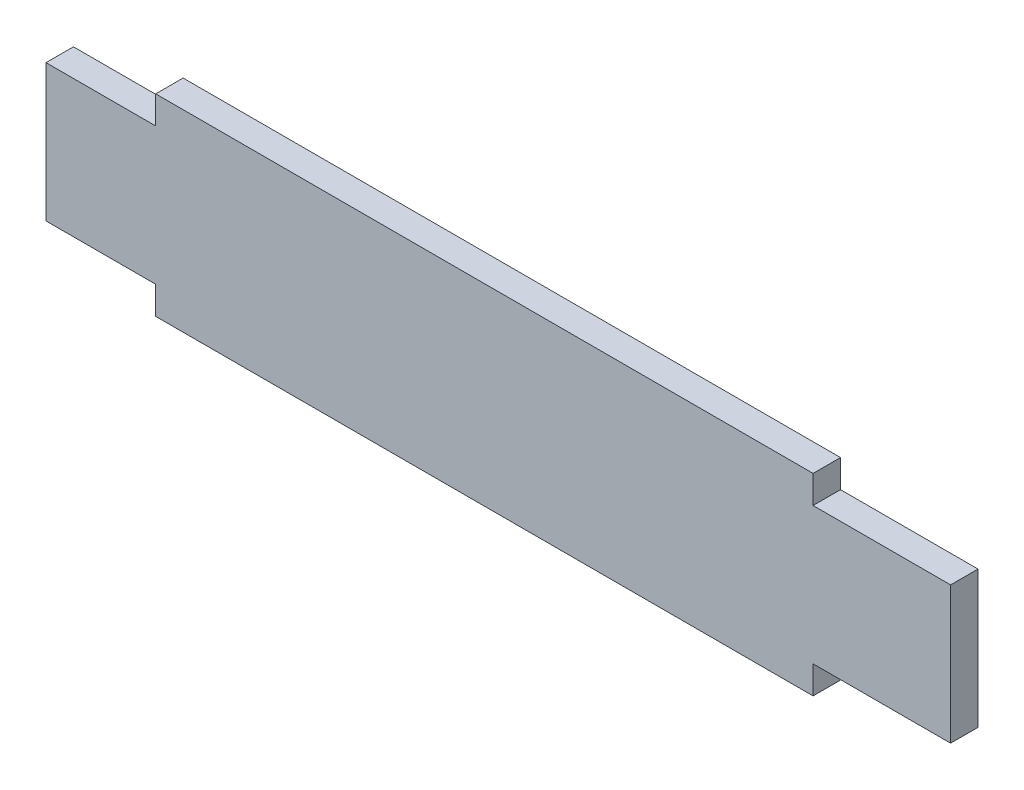
ISO-10303-21;
HEADER;
FILE_DESCRIPTION(('STEP AP214'),'2;1');
FILE_NAME('part.step','',(''),(''),'','','');
FILE_SCHEMA(('AUTOMOTIVE_DESIGN { 1 0 10303 214 1 1 1 1 }'));
ENDSEC;
DATA;
#1=APPLICATION_CONTEXT('core data for automotive mechanical design processes');
#2=APPLICATION_PROTOCOL_DEFINITION('international standard','automotive_design',2000,#1);
#3=PRODUCT_CONTEXT('',#1,'mechanical');
#4=PRODUCT('Part','Part','',(#3));
#5=PRODUCT_RELATED_PRODUCT_CATEGORY('part','',(#4));
#6=PRODUCT_DEFINITION_FORMATION('','',#4);
#7=PRODUCT_DEFINITION_CONTEXT('part definition',#1,'design');
#8=PRODUCT_DEFINITION('design','',#6,#7);
#9=PRODUCT_DEFINITION_SHAPE('','',#8);
#10=(LENGTH_UNIT() NAMED_UNIT(*) SI_UNIT(.MILLI.,.METRE.));
#11=(NAMED_UNIT(*) PLANE_ANGLE_UNIT() SI_UNIT($,.RADIAN.));
#12=(NAMED_UNIT(*) SI_UNIT($,.STERADIAN.) SOLID_ANGLE_UNIT());
#13=UNCERTAINTY_MEASURE_WITH_UNIT(LENGTH_MEASURE(1.E-05),#10,'distance_accuracy_value','');
#14=(GEOMETRIC_REPRESENTATION_CONTEXT(3) GLOBAL_UNCERTAINTY_ASSIGNED_CONTEXT((#13)) GLOBAL_UNIT_ASSIGNED_CONTEXT((#10,
#11,#12)) REPRESENTATION_CONTEXT('',''));
#15=CARTESIAN_POINT('',(0.,0.,0.));
#16=DIRECTION('',(0.,0.,1.));
#17=DIRECTION('',(1.,0.,0.));
#18=AXIS2_PLACEMENT_3D('',#15,#16,#17);
#19=CARTESIAN_POINT('',(0.,0.,5.));
#20=DIRECTION('',(0.,1.,0.));
#21=DIRECTION('',(0.,0.,1.));
#22=AXIS2_PLACEMENT_3D('',#19,#20,#21);
#23=PLANE('',#22);
#24=DIRECTION('',(1.,0.,0.));
#25=VECTOR('',#24,1.);
#26=CARTESIAN_POINT('',(0.,0.,0.));
#27=LINE('',#26,#25);
#28=CARTESIAN_POINT('',(0.,0.,0.));
#29=VERTEX_POINT('',#28);
#30=CARTESIAN_POINT('',(20.,0.,0.));
#31=VERTEX_POINT('',#30);
#32=EDGE_CURVE('E212',#29,#31,#27,.T.);
#33=ORIENTED_EDGE('',*,*,#32,.T.);
#34=DIRECTION('',(0.,0.,-1.));
#35=VECTOR('',#34,1.);
#36=CARTESIAN_POINT('',(20.,0.,5.));
#37=LINE('',#36,#35);
#38=CARTESIAN_POINT('',(20.,0.,5.));
#39=VERTEX_POINT('',#38);
#40=EDGE_CURVE('E11',#39,#31,#37,.T.);
#41=ORIENTED_EDGE('',*,*,#40,.F.);
#42=DIRECTION('',(1.,0.,0.));
#43=VECTOR('',#42,1.);
#44=CARTESIAN_POINT('',(0.,0.,5.));
#45=LINE('',#44,#43);
#46=CARTESIAN_POINT('',(0.,0.,5.));
#47=VERTEX_POINT('',#46);
#48=EDGE_CURVE('E169',#47,#39,#45,.T.);
#49=ORIENTED_EDGE('',*,*,#48,.F.);
#50=DIRECTION('',(0.,0.,-1.));
#51=VECTOR('',#50,1.);
#52=CARTESIAN_POINT('',(0.,0.,5.));
#53=LINE('',#52,#51);
#54=EDGE_CURVE('E54',#47,#29,#53,.T.);
#55=ORIENTED_EDGE('',*,*,#54,.T.);
#56=EDGE_LOOP('',(#33,#41,#49,#55));
#57=FACE_BOUND('',#56,.T.);
#58=ADVANCED_FACE('F37',(#57),#23,.F.);
#59=CARTESIAN_POINT('',(20.,0.,5.));
#60=DIRECTION('',(1.,0.,0.));
#61=DIRECTION('',(0.,0.,-1.));
#62=AXIS2_PLACEMENT_3D('',#59,#60,#61);
#63=PLANE('',#62);
#64=DIRECTION('',(0.,-1.,0.));
#65=VECTOR('',#64,1.);
#66=CARTESIAN_POINT('',(20.,0.,0.));
#67=LINE('',#66,#65);
#68=CARTESIAN_POINT('',(20.,-5.06999999999997,0.));
#69=VERTEX_POINT('',#68);
#70=EDGE_CURVE('E211',#31,#69,#67,.T.);
#71=ORIENTED_EDGE('',*,*,#70,.T.);
#72=DIRECTION('',(0.,0.,-1.));
#73=VECTOR('',#72,1.);
#74=CARTESIAN_POINT('',(20.,-5.06999999999997,5.));
#75=LINE('',#74,#73);
#76=CARTESIAN_POINT('',(20.,-5.06999999999997,5.));
#77=VERTEX_POINT('',#76);
#78=EDGE_CURVE('E46',#77,#69,#75,.T.);
#79=ORIENTED_EDGE('',*,*,#78,.F.);
#80=DIRECTION('',(0.,-1.,0.));
#81=VECTOR('',#80,1.);
#82=CARTESIAN_POINT('',(20.,0.,5.));
#83=LINE('',#82,#81);
#84=EDGE_CURVE('E104',#39,#77,#83,.T.);
#85=ORIENTED_EDGE('',*,*,#84,.F.);
#86=ORIENTED_EDGE('',*,*,#40,.T.);
#87=EDGE_LOOP('',(#71,#79,#85,#86));
#88=FACE_BOUND('',#87,.T.);
#89=ADVANCED_FACE('F39',(#88),#63,.F.);
#90=CARTESIAN_POINT('',(0.,-5.06999999999997,5.));
#91=DIRECTION('',(0.,-1.,0.));
#92=DIRECTION('',(1.,0.,0.));
#93=AXIS2_PLACEMENT_3D('',#90,#91,#92);
#94=PLANE('',#93);
#95=DIRECTION('',(-1.,0.,0.));
#96=VECTOR('',#95,1.);
#97=CARTESIAN_POINT('',(0.,-5.06999999999997,0.));
#98=LINE('',#97,#96);
#99=CARTESIAN_POINT('',(139.86,-5.07,0.));
#100=VERTEX_POINT('',#99);
#101=EDGE_CURVE('E208',#100,#69,#98,.T.);
#102=ORIENTED_EDGE('',*,*,#101,.F.);
#103=DIRECTION('',(0.,0.,-1.));
#104=VECTOR('',#103,1.);
#105=CARTESIAN_POINT('',(139.86,-5.07,5.));
#106=LINE('',#105,#104);
#107=CARTESIAN_POINT('',(139.86,-5.07,5.));
#108=VERTEX_POINT('',#107);
#109=EDGE_CURVE('E202',#108,#100,#106,.T.);
#110=ORIENTED_EDGE('',*,*,#109,.F.);
#111=DIRECTION('',(-1.,0.,0.));
#112=VECTOR('',#111,1.);
#113=CARTESIAN_POINT('',(0.,-5.06999999999997,5.));
#114=LINE('',#113,#112);
#115=EDGE_CURVE('E173',#108,#77,#114,.T.);
#116=ORIENTED_EDGE('',*,*,#115,.T.);
#117=ORIENTED_EDGE('',*,*,#78,.T.);
#118=EDGE_LOOP('',(#102,#110,#116,#117));
#119=FACE_BOUND('',#118,.T.);
#120=ADVANCED_FACE('F206',(#119),#94,.T.);
#121=CARTESIAN_POINT('',(139.86,0.,5.));
#122=DIRECTION('',(1.,0.,0.));
#123=DIRECTION('',(0.,0.,-1.));
#124=AXIS2_PLACEMENT_3D('',#121,#122,#123);
#125=PLANE('',#124);
#126=DIRECTION('',(0.,-1.,0.));
#127=VECTOR('',#126,1.);
#128=CARTESIAN_POINT('',(139.86,0.,0.));
#129=LINE('',#128,#127);
#130=CARTESIAN_POINT('',(139.86,0.,0.));
#131=VERTEX_POINT('',#130);
#132=EDGE_CURVE('E217',#131,#100,#129,.T.);
#133=ORIENTED_EDGE('',*,*,#132,.F.);
#134=DIRECTION('',(0.,0.,-1.));
#135=VECTOR('',#134,1.);
#136=CARTESIAN_POINT('',(139.86,0.,5.));
#137=LINE('',#136,#135);
#138=CARTESIAN_POINT('',(139.86,0.,5.));
#139=VERTEX_POINT('',#138);
#140=EDGE_CURVE('E200',#139,#131,#137,.T.);
#141=ORIENTED_EDGE('',*,*,#140,.F.);
#142=DIRECTION('',(0.,-1.,0.));
#143=VECTOR('',#142,1.);
#144=CARTESIAN_POINT('',(139.86,0.,5.));
#145=LINE('',#144,#143);
#146=EDGE_CURVE('E167',#139,#108,#145,.T.);
#147=ORIENTED_EDGE('',*,*,#146,.T.);
#148=ORIENTED_EDGE('',*,*,#109,.T.);
#149=EDGE_LOOP('',(#133,#141,#147,#148));
#150=FACE_BOUND('',#149,.T.);
#151=ADVANCED_FACE('F244',(#150),#125,.T.);
#152=CARTESIAN_POINT('',(164.93,0.,0.));
#153=VERTEX_POINT('',#152);
#154=EDGE_CURVE('E219',#131,#153,#27,.T.);
#155=ORIENTED_EDGE('',*,*,#154,.T.);
#156=DIRECTION('',(0.,0.,-1.));
#157=VECTOR('',#156,1.);
#158=CARTESIAN_POINT('',(164.93,0.,5.));
#159=LINE('',#158,#157);
#160=CARTESIAN_POINT('',(164.93,0.,5.));
#161=VERTEX_POINT('',#160);
#162=EDGE_CURVE('E197',#161,#153,#159,.T.);
#163=ORIENTED_EDGE('',*,*,#162,.F.);
#164=EDGE_CURVE('E164',#139,#161,#45,.T.);
#165=ORIENTED_EDGE('',*,*,#164,.F.);
#166=ORIENTED_EDGE('',*,*,#140,.T.);
#167=EDGE_LOOP('',(#155,#163,#165,#166));
#168=FACE_BOUND('',#167,.T.);
#169=ADVANCED_FACE('F247',(#168),#23,.F.);
#170=CARTESIAN_POINT('',(164.93,0.,5.));
#171=DIRECTION('',(-1.,0.,0.));
#172=DIRECTION('',(0.,0.,1.));
#173=AXIS2_PLACEMENT_3D('',#170,#171,#172);
#174=PLANE('',#173);
#175=DIRECTION('',(0.,1.,0.));
#176=VECTOR('',#175,1.);
#177=CARTESIAN_POINT('',(164.93,0.,0.));
#178=LINE('',#177,#176);
#179=CARTESIAN_POINT('',(164.93,25.,0.));
#180=VERTEX_POINT('',#179);
#181=EDGE_CURVE('E223',#153,#180,#178,.T.);
#182=ORIENTED_EDGE('',*,*,#181,.T.);
#183=DIRECTION('',(0.,0.,-1.));
#184=VECTOR('',#183,1.);
#185=CARTESIAN_POINT('',(164.93,25.,5.));
#186=LINE('',#185,#184);
#187=CARTESIAN_POINT('',(164.93,25.,5.));
#188=VERTEX_POINT('',#187);
#189=EDGE_CURVE('E195',#188,#180,#186,.T.);
#190=ORIENTED_EDGE('',*,*,#189,.F.);
#191=DIRECTION('',(0.,1.,0.));
#192=VECTOR('',#191,1.);
#193=CARTESIAN_POINT('',(164.93,0.,5.));
#194=LINE('',#193,#192);
#195=EDGE_CURVE('E161',#161,#188,#194,.T.);
#196=ORIENTED_EDGE('',*,*,#195,.F.);
#197=ORIENTED_EDGE('',*,*,#162,.T.);
#198=EDGE_LOOP('',(#182,#190,#196,#197));
#199=FACE_BOUND('',#198,.T.);
#200=ADVANCED_FACE('F240',(#199),#174,.F.);
#201=CARTESIAN_POINT('',(0.,25.,5.));
#202=DIRECTION('',(0.,1.,0.));
#203=DIRECTION('',(0.,0.,1.));
#204=AXIS2_PLACEMENT_3D('',#201,#202,#203);
#205=PLANE('',#204);
#206=DIRECTION('',(1.,0.,0.));
#207=VECTOR('',#206,1.);
#208=CARTESIAN_POINT('',(0.,25.,0.));
#209=LINE('',#208,#207);
#210=CARTESIAN_POINT('',(139.86,25.,0.));
#211=VERTEX_POINT('',#210);
#212=EDGE_CURVE('E183',#211,#180,#209,.T.);
#213=ORIENTED_EDGE('',*,*,#212,.F.);
#214=DIRECTION('',(0.,0.,-1.));
#215=VECTOR('',#214,1.);
#216=CARTESIAN_POINT('',(139.86,25.,5.));
#217=LINE('',#216,#215);
#218=CARTESIAN_POINT('',(139.86,25.,5.));
#219=VERTEX_POINT('',#218);
#220=EDGE_CURVE('E193',#219,#211,#217,.T.);
#221=ORIENTED_EDGE('',*,*,#220,.F.);
#222=DIRECTION('',(1.,0.,0.));
#223=VECTOR('',#222,1.);
#224=CARTESIAN_POINT('',(0.,25.,5.));
#225=LINE('',#224,#223);
#226=EDGE_CURVE('E155',#219,#188,#225,.T.);
#227=ORIENTED_EDGE('',*,*,#226,.T.);
#228=ORIENTED_EDGE('',*,*,#189,.T.);
#229=EDGE_LOOP('',(#213,#221,#227,#228));
#230=FACE_BOUND('',#229,.T.);
#231=ADVANCED_FACE('F237',(#230),#205,.T.);
#232=CARTESIAN_POINT('',(139.86,0.,5.));
#233=DIRECTION('',(-1.,0.,0.));
#234=DIRECTION('',(0.,0.,1.));
#235=AXIS2_PLACEMENT_3D('',#232,#233,#234);
#236=PLANE('',#235);
#237=DIRECTION('',(0.,1.,0.));
#238=VECTOR('',#237,1.);
#239=CARTESIAN_POINT('',(139.86,0.,0.));
#240=LINE('',#239,#238);
#241=CARTESIAN_POINT('',(139.86,30.07,0.));
#242=VERTEX_POINT('',#241);
#243=EDGE_CURVE('E227',#211,#242,#240,.T.);
#244=ORIENTED_EDGE('',*,*,#243,.T.);
#245=DIRECTION('',(0.,0.,-1.));
#246=VECTOR('',#245,1.);
#247=CARTESIAN_POINT('',(139.86,30.07,5.));
#248=LINE('',#247,#246);
#249=CARTESIAN_POINT('',(139.86,30.07,5.));
#250=VERTEX_POINT('',#249);
#251=EDGE_CURVE('E190',#250,#242,#248,.T.);
#252=ORIENTED_EDGE('',*,*,#251,.F.);
#253=DIRECTION('',(0.,1.,0.));
#254=VECTOR('',#253,1.);
#255=CARTESIAN_POINT('',(139.86,0.,5.));
#256=LINE('',#255,#254);
#257=EDGE_CURVE('E160',#219,#250,#256,.T.);
#258=ORIENTED_EDGE('',*,*,#257,.F.);
#259=ORIENTED_EDGE('',*,*,#220,.T.);
#260=EDGE_LOOP('',(#244,#252,#258,#259));
#261=FACE_BOUND('',#260,.T.);
#262=ADVANCED_FACE('F277',(#261),#236,.F.);
#263=CARTESIAN_POINT('',(0.,30.07,5.));
#264=DIRECTION('',(0.,-1.,0.));
#265=DIRECTION('',(1.,0.,0.));
#266=AXIS2_PLACEMENT_3D('',#263,#264,#265);
#267=PLANE('',#266);
#268=DIRECTION('',(-1.,0.,0.));
#269=VECTOR('',#268,1.);
#270=CARTESIAN_POINT('',(0.,30.07,0.));
#271=LINE('',#270,#269);
#272=CARTESIAN_POINT('',(20.,30.07,0.));
#273=VERTEX_POINT('',#272);
#274=EDGE_CURVE('E228',#242,#273,#271,.T.);
#275=ORIENTED_EDGE('',*,*,#274,.T.);
#276=DIRECTION('',(0.,0.,-1.));
#277=VECTOR('',#276,1.);
#278=CARTESIAN_POINT('',(20.,30.07,5.));
#279=LINE('',#278,#277);
#280=CARTESIAN_POINT('',(20.,30.07,5.));
#281=VERTEX_POINT('',#280);
#282=EDGE_CURVE('E141',#281,#273,#279,.T.);
#283=ORIENTED_EDGE('',*,*,#282,.F.);
#284=DIRECTION('',(-1.,0.,0.));
#285=VECTOR('',#284,1.);
#286=CARTESIAN_POINT('',(0.,30.07,5.));
#287=LINE('',#286,#285);
#288=EDGE_CURVE('E149',#250,#281,#287,.T.);
#289=ORIENTED_EDGE('',*,*,#288,.F.);
#290=ORIENTED_EDGE('',*,*,#251,.T.);
#291=EDGE_LOOP('',(#275,#283,#289,#290));
#292=FACE_BOUND('',#291,.T.);
#293=ADVANCED_FACE('F274',(#292),#267,.F.);
#294=CARTESIAN_POINT('',(20.,0.,5.));
#295=DIRECTION('',(-1.,0.,0.));
#296=DIRECTION('',(0.,0.,1.));
#297=AXIS2_PLACEMENT_3D('',#294,#295,#296);
#298=PLANE('',#297);
#299=DIRECTION('',(0.,1.,0.));
#300=VECTOR('',#299,1.);
#301=CARTESIAN_POINT('',(20.,0.,0.));
#302=LINE('',#301,#300);
#303=CARTESIAN_POINT('',(20.,25.,0.));
#304=VERTEX_POINT('',#303);
#305=EDGE_CURVE('E137',#304,#273,#302,.T.);
#306=ORIENTED_EDGE('',*,*,#305,.F.);
#307=DIRECTION('',(0.,0.,-1.));
#308=VECTOR('',#307,1.);
#309=CARTESIAN_POINT('',(20.,25.,5.));
#310=LINE('',#309,#308);
#311=CARTESIAN_POINT('',(20.,25.,5.));
#312=VERTEX_POINT('',#311);
#313=EDGE_CURVE('E132',#312,#304,#310,.T.);
#314=ORIENTED_EDGE('',*,*,#313,.F.);
#315=DIRECTION('',(0.,1.,0.));
#316=VECTOR('',#315,1.);
#317=CARTESIAN_POINT('',(20.,0.,5.));
#318=LINE('',#317,#316);
#319=EDGE_CURVE('E135',#312,#281,#318,.T.);
#320=ORIENTED_EDGE('',*,*,#319,.T.);
#321=ORIENTED_EDGE('',*,*,#282,.T.);
#322=EDGE_LOOP('',(#306,#314,#320,#321));
#323=FACE_BOUND('',#322,.T.);
#324=ADVANCED_FACE('F134',(#323),#298,.T.);
#325=CARTESIAN_POINT('',(0.,25.,0.));
#326=VERTEX_POINT('',#325);
#327=EDGE_CURVE('E179',#326,#304,#209,.T.);
#328=ORIENTED_EDGE('',*,*,#327,.F.);
#329=DIRECTION('',(0.,0.,-1.));
#330=VECTOR('',#329,1.);
#331=CARTESIAN_POINT('',(0.,25.,5.));
#332=LINE('',#331,#330);
#333=CARTESIAN_POINT('',(0.,25.,5.));
#334=VERTEX_POINT('',#333);
#335=EDGE_CURVE('E92',#334,#326,#332,.T.);
#336=ORIENTED_EDGE('',*,*,#335,.F.);
#337=EDGE_CURVE('E147',#334,#312,#225,.T.);
#338=ORIENTED_EDGE('',*,*,#337,.T.);
#339=ORIENTED_EDGE('',*,*,#313,.T.);
#340=EDGE_LOOP('',(#328,#336,#338,#339));
#341=FACE_BOUND('',#340,.T.);
#342=ADVANCED_FACE('F152',(#341),#205,.T.);
#343=CARTESIAN_POINT('',(0.,0.,5.));
#344=DIRECTION('',(-1.,0.,0.));
#345=DIRECTION('',(0.,0.,1.));
#346=AXIS2_PLACEMENT_3D('',#343,#344,#345);
#347=PLANE('',#346);
#348=DIRECTION('',(0.,1.,0.));
#349=VECTOR('',#348,1.);
#350=CARTESIAN_POINT('',(0.,0.,0.));
#351=LINE('',#350,#349);
#352=EDGE_CURVE('E176',#29,#326,#351,.T.);
#353=ORIENTED_EDGE('',*,*,#352,.F.);
#354=ORIENTED_EDGE('',*,*,#54,.F.);
#355=DIRECTION('',(0.,1.,0.));
#356=VECTOR('',#355,1.);
#357=CARTESIAN_POINT('',(0.,0.,5.));
#358=LINE('',#357,#356);
#359=EDGE_CURVE('E153',#47,#334,#358,.T.);
#360=ORIENTED_EDGE('',*,*,#359,.T.);
#361=ORIENTED_EDGE('',*,*,#335,.T.);
#362=EDGE_LOOP('',(#353,#354,#360,#361));
#363=FACE_BOUND('',#362,.T.);
#364=ADVANCED_FACE('F261',(#363),#347,.T.);
#365=CARTESIAN_POINT('',(0.,0.,5.));
#366=DIRECTION('',(0.,0.,1.));
#367=DIRECTION('',(1.,0.,0.));
#368=AXIS2_PLACEMENT_3D('',#365,#366,#367);
#369=PLANE('',#368);
#370=ORIENTED_EDGE('',*,*,#48,.T.);
#371=ORIENTED_EDGE('',*,*,#84,.T.);
#372=ORIENTED_EDGE('',*,*,#115,.F.);
#373=ORIENTED_EDGE('',*,*,#146,.F.);
#374=ORIENTED_EDGE('',*,*,#164,.T.);
#375=ORIENTED_EDGE('',*,*,#195,.T.);
#376=ORIENTED_EDGE('',*,*,#226,.F.);
#377=ORIENTED_EDGE('',*,*,#257,.T.);
#378=ORIENTED_EDGE('',*,*,#288,.T.);
#379=ORIENTED_EDGE('',*,*,#319,.F.);
#380=ORIENTED_EDGE('',*,*,#337,.F.);
#381=ORIENTED_EDGE('',*,*,#359,.F.);
#382=EDGE_LOOP('',(#370,#371,#372,#373,#374,#375,#376,#377,#378,#379,#380,#381));
#383=FACE_BOUND('',#382,.T.);
#384=ADVANCED_FACE('F145',(#383),#369,.T.);
#385=CARTESIAN_POINT('',(0.,0.,0.));
#386=DIRECTION('',(0.,0.,1.));
#387=DIRECTION('',(1.,0.,0.));
#388=AXIS2_PLACEMENT_3D('',#385,#386,#387);
#389=PLANE('',#388);
#390=ORIENTED_EDGE('',*,*,#32,.F.);
#391=ORIENTED_EDGE('',*,*,#352,.T.);
#392=ORIENTED_EDGE('',*,*,#327,.T.);
#393=ORIENTED_EDGE('',*,*,#305,.T.);
#394=ORIENTED_EDGE('',*,*,#274,.F.);
#395=ORIENTED_EDGE('',*,*,#243,.F.);
#396=ORIENTED_EDGE('',*,*,#212,.T.);
#397=ORIENTED_EDGE('',*,*,#181,.F.);
#398=ORIENTED_EDGE('',*,*,#154,.F.);
#399=ORIENTED_EDGE('',*,*,#132,.T.);
#400=ORIENTED_EDGE('',*,*,#101,.T.);
#401=ORIENTED_EDGE('',*,*,#70,.F.);
#402=EDGE_LOOP('',(#390,#391,#392,#393,#394,#395,#396,#397,#398,#399,#400,#401));
#403=FACE_BOUND('',#402,.T.);
#404=ADVANCED_FACE('F214',(#403),#389,.F.);
#405=CLOSED_SHELL('',(#58,#89,#120,#151,#169,#200,#231,#262,#293,#324,#342,#364,#384,#404));
#406=MANIFOLD_SOLID_BREP('B2',#405);
#407=ADVANCED_BREP_SHAPE_REPRESENTATION('',(#18,#406),#14);
#408=SHAPE_DEFINITION_REPRESENTATION(#9,#407);
ENDSEC;
END-ISO-10303-21;
